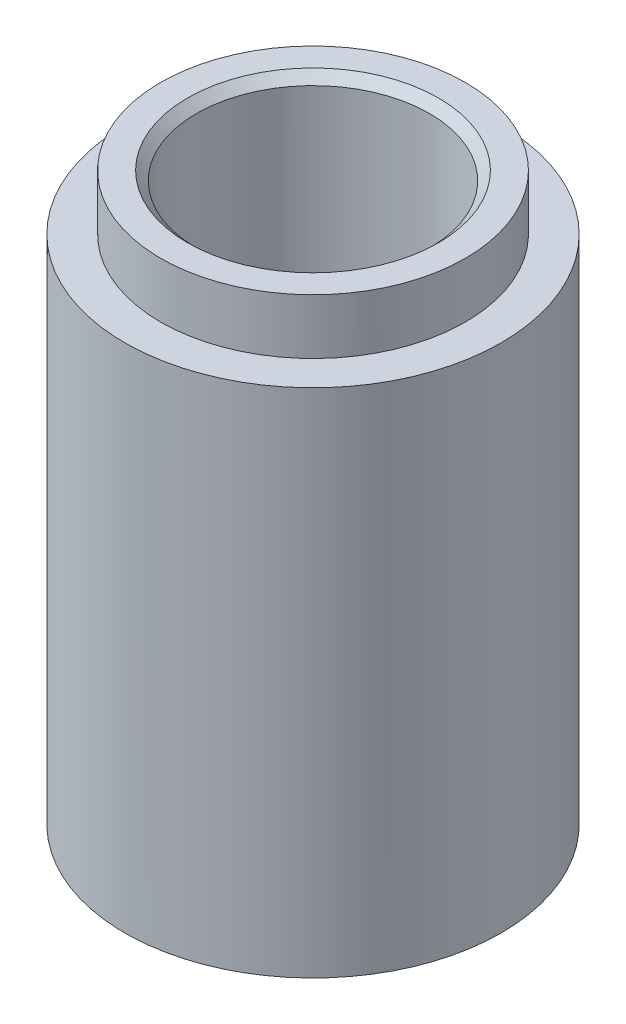
ISO-10303-21;
HEADER;
FILE_DESCRIPTION(('STEP AP214'),'2;1');
FILE_NAME('part.step','',(''),(''),'','','');
FILE_SCHEMA(('AUTOMOTIVE_DESIGN { 1 0 10303 214 1 1 1 1 }'));
ENDSEC;
DATA;
#1=APPLICATION_CONTEXT('core data for automotive mechanical design processes');
#2=APPLICATION_PROTOCOL_DEFINITION('international standard','automotive_design',2000,#1);
#3=PRODUCT_CONTEXT('',#1,'mechanical');
#4=PRODUCT('Part','Part','',(#3));
#5=PRODUCT_RELATED_PRODUCT_CATEGORY('part','',(#4));
#6=PRODUCT_DEFINITION_FORMATION('','',#4);
#7=PRODUCT_DEFINITION_CONTEXT('part definition',#1,'design');
#8=PRODUCT_DEFINITION('design','',#6,#7);
#9=PRODUCT_DEFINITION_SHAPE('','',#8);
#10=(LENGTH_UNIT() NAMED_UNIT(*) SI_UNIT(.MILLI.,.METRE.));
#11=(NAMED_UNIT(*) PLANE_ANGLE_UNIT() SI_UNIT($,.RADIAN.));
#12=(NAMED_UNIT(*) SI_UNIT($,.STERADIAN.) SOLID_ANGLE_UNIT());
#13=UNCERTAINTY_MEASURE_WITH_UNIT(LENGTH_MEASURE(1.E-05),#10,'distance_accuracy_value','');
#14=(GEOMETRIC_REPRESENTATION_CONTEXT(3) GLOBAL_UNCERTAINTY_ASSIGNED_CONTEXT((#13)) GLOBAL_UNIT_ASSIGNED_CONTEXT((#10,
#11,#12)) REPRESENTATION_CONTEXT('',''));
#15=CARTESIAN_POINT('',(0.,0.,0.));
#16=DIRECTION('',(0.,0.,1.));
#17=DIRECTION('',(1.,0.,0.));
#18=AXIS2_PLACEMENT_3D('',#15,#16,#17);
#19=CARTESIAN_POINT('',(81.28,-119.247044001362,0.));
#20=DIRECTION('',(0.,-1.,0.));
#21=DIRECTION('',(0.,0.,-1.));
#22=AXIS2_PLACEMENT_3D('',#19,#20,#21);
#23=CYLINDRICAL_SURFACE('',#22,41.275);
#24=CARTESIAN_POINT('',(81.28,-122.422044001362,0.));
#25=DIRECTION('',(0.,-1.,0.));
#26=DIRECTION('',(0.,0.,-1.));
#27=AXIS2_PLACEMENT_3D('',#24,#25,#26);
#28=CIRCLE('',#27,41.275);
#29=CARTESIAN_POINT('',(81.28,-122.422044001362,-41.275));
#30=VERTEX_POINT('',#29);
#31=EDGE_CURVE('E11',#30,#30,#28,.F.);
#32=ORIENTED_EDGE('',*,*,#31,.T.);
#33=EDGE_LOOP('',(#32));
#34=FACE_BOUND('',#33,.T.);
#35=CARTESIAN_POINT('',(81.28,-319.895132004085,0.));
#36=DIRECTION('',(0.,-1.,0.));
#37=DIRECTION('',(1.,0.,0.));
#38=AXIS2_PLACEMENT_3D('',#35,#36,#37);
#39=CIRCLE('',#38,41.275);
#40=CARTESIAN_POINT('',(122.555,-319.895132004085,0.));
#41=VERTEX_POINT('',#40);
#42=EDGE_CURVE('E264',#41,#41,#39,.T.);
#43=ORIENTED_EDGE('',*,*,#42,.T.);
#44=EDGE_LOOP('',(#43));
#45=FACE_BOUND('',#44,.T.);
#46=ADVANCED_FACE('F16',(#34,#45),#23,.F.);
#47=CARTESIAN_POINT('',(81.28,-119.247044001362,0.));
#48=DIRECTION('',(0.,-1.,0.));
#49=DIRECTION('',(0.,0.,-1.));
#50=AXIS2_PLACEMENT_3D('',#47,#48,#49);
#51=CYLINDRICAL_SURFACE('',#50,53.975);
#52=CARTESIAN_POINT('',(81.28,-119.247044001362,0.));
#53=DIRECTION('',(0.,-1.,0.));
#54=DIRECTION('',(1.,0.,0.));
#55=AXIS2_PLACEMENT_3D('',#52,#53,#54);
#56=CIRCLE('',#55,53.975);
#57=CARTESIAN_POINT('',(135.255,-119.247044001362,0.));
#58=VERTEX_POINT('',#57);
#59=EDGE_CURVE('E268',#58,#58,#56,.T.);
#60=ORIENTED_EDGE('',*,*,#59,.T.);
#61=EDGE_LOOP('',(#60));
#62=FACE_BOUND('',#61,.T.);
#63=CARTESIAN_POINT('',(81.28,-138.805044001362,0.));
#64=DIRECTION('',(0.,-1.,0.));
#65=DIRECTION('',(0.,0.,-1.));
#66=AXIS2_PLACEMENT_3D('',#63,#64,#65);
#67=CIRCLE('',#66,53.975);
#68=CARTESIAN_POINT('',(81.28,-138.805044001362,-53.975));
#69=VERTEX_POINT('',#68);
#70=EDGE_CURVE('E267',#69,#69,#67,.T.);
#71=ORIENTED_EDGE('',*,*,#70,.F.);
#72=EDGE_LOOP('',(#71));
#73=FACE_BOUND('',#72,.T.);
#74=ADVANCED_FACE('F83',(#62,#73),#51,.T.);
#75=CARTESIAN_POINT('',(81.28,-119.247044001362,0.));
#76=DIRECTION('',(0.,-1.,0.));
#77=DIRECTION('',(0.,0.,-1.));
#78=AXIS2_PLACEMENT_3D('',#75,#76,#77);
#79=PLANE('',#78);
#80=CARTESIAN_POINT('',(81.28,-119.247044001362,0.));
#81=DIRECTION('',(0.,-1.,0.));
#82=DIRECTION('',(0.,0.,-1.));
#83=AXIS2_PLACEMENT_3D('',#80,#81,#82);
#84=CIRCLE('',#83,44.45);
#85=CARTESIAN_POINT('',(81.28,-119.247044001362,-44.45));
#86=VERTEX_POINT('',#85);
#87=EDGE_CURVE('E25',#86,#86,#84,.T.);
#88=ORIENTED_EDGE('',*,*,#87,.T.);
#89=EDGE_LOOP('',(#88));
#90=FACE_BOUND('',#89,.T.);
#91=ORIENTED_EDGE('',*,*,#59,.F.);
#92=EDGE_LOOP('',(#91));
#93=FACE_BOUND('',#92,.T.);
#94=ADVANCED_FACE('F89',(#90,#93),#79,.F.);
#95=CARTESIAN_POINT('',(81.28,-319.895132004085,0.));
#96=DIRECTION('',(0.,1.,0.));
#97=DIRECTION('',(0.,0.,1.));
#98=AXIS2_PLACEMENT_3D('',#95,#96,#97);
#99=CYLINDRICAL_SURFACE('',#98,66.675);
#100=CARTESIAN_POINT('',(81.28,-319.895132004085,0.));
#101=DIRECTION('',(0.,-1.,0.));
#102=DIRECTION('',(1.,0.,0.));
#103=AXIS2_PLACEMENT_3D('',#100,#101,#102);
#104=CIRCLE('',#103,66.675);
#105=CARTESIAN_POINT('',(147.955,-319.895132004085,0.));
#106=VERTEX_POINT('',#105);
#107=EDGE_CURVE('E261',#106,#106,#104,.T.);
#108=ORIENTED_EDGE('',*,*,#107,.F.);
#109=EDGE_LOOP('',(#108));
#110=FACE_BOUND('',#109,.T.);
#111=CARTESIAN_POINT('',(81.28,-138.805044001362,0.));
#112=DIRECTION('',(0.,-1.,0.));
#113=DIRECTION('',(0.,0.,-1.));
#114=AXIS2_PLACEMENT_3D('',#111,#112,#113);
#115=CIRCLE('',#114,66.675);
#116=CARTESIAN_POINT('',(81.28,-138.805044001362,-66.675));
#117=VERTEX_POINT('',#116);
#118=EDGE_CURVE('E20',#117,#117,#115,.T.);
#119=ORIENTED_EDGE('',*,*,#118,.T.);
#120=EDGE_LOOP('',(#119));
#121=FACE_BOUND('',#120,.T.);
#122=ADVANCED_FACE('F95',(#110,#121),#99,.T.);
#123=CARTESIAN_POINT('',(81.28,-319.895132004085,0.));
#124=DIRECTION('',(0.,-1.,0.));
#125=DIRECTION('',(0.,0.,-1.));
#126=AXIS2_PLACEMENT_3D('',#123,#124,#125);
#127=PLANE('',#126);
#128=CARTESIAN_POINT('',(51.1175,-319.895132004085,52.2429824832962));
#129=DIRECTION('',(0.,1.,0.));
#130=DIRECTION('',(-0.5,0.,0.866025403784438));
#131=AXIS2_PLACEMENT_3D('',#128,#129,#130);
#132=CIRCLE('',#131,3.175);
#133=CARTESIAN_POINT('',(49.53,-319.895132004085,54.9926131403118));
#134=VERTEX_POINT('',#133);
#135=EDGE_CURVE('E202',#134,#134,#132,.T.);
#136=ORIENTED_EDGE('',*,*,#135,.T.);
#137=EDGE_LOOP('',(#136));
#138=FACE_BOUND('',#137,.T.);
#139=CARTESIAN_POINT('',(29.0370175167037,-319.895132004085,30.1625));
#140=DIRECTION('',(0.,1.,0.));
#141=DIRECTION('',(-0.866025403784439,0.,0.5));
#142=AXIS2_PLACEMENT_3D('',#139,#140,#141);
#143=CIRCLE('',#142,3.175);
#144=CARTESIAN_POINT('',(26.2873868596881,-319.895132004085,31.75));
#145=VERTEX_POINT('',#144);
#146=EDGE_CURVE('E193',#145,#145,#143,.T.);
#147=ORIENTED_EDGE('',*,*,#146,.T.);
#148=EDGE_LOOP('',(#147));
#149=FACE_BOUND('',#148,.T.);
#150=CARTESIAN_POINT('',(20.955,-319.895132004085,0.));
#151=DIRECTION('',(0.,1.,0.));
#152=DIRECTION('',(-1.,0.,0.));
#153=AXIS2_PLACEMENT_3D('',#150,#151,#152);
#154=CIRCLE('',#153,3.175);
#155=CARTESIAN_POINT('',(17.78,-319.895132004085,0.));
#156=VERTEX_POINT('',#155);
#157=EDGE_CURVE('E192',#156,#156,#154,.T.);
#158=ORIENTED_EDGE('',*,*,#157,.T.);
#159=EDGE_LOOP('',(#158));
#160=FACE_BOUND('',#159,.T.);
#161=CARTESIAN_POINT('',(29.0370175167038,-319.895132004085,-30.1625));
#162=DIRECTION('',(0.,1.,0.));
#163=DIRECTION('',(-0.866025403784438,0.,-0.5));
#164=AXIS2_PLACEMENT_3D('',#161,#162,#163);
#165=CIRCLE('',#164,3.175);
#166=CARTESIAN_POINT('',(26.2873868596882,-319.895132004085,-31.75));
#167=VERTEX_POINT('',#166);
#168=EDGE_CURVE('E206',#167,#167,#165,.T.);
#169=ORIENTED_EDGE('',*,*,#168,.T.);
#170=EDGE_LOOP('',(#169));
#171=FACE_BOUND('',#170,.T.);
#172=CARTESIAN_POINT('',(51.1175,-319.895132004085,-52.2429824832962));
#173=DIRECTION('',(0.,1.,0.));
#174=DIRECTION('',(-0.5,0.,-0.866025403784439));
#175=AXIS2_PLACEMENT_3D('',#172,#173,#174);
#176=CIRCLE('',#175,3.175);
#177=CARTESIAN_POINT('',(49.53,-319.895132004085,-54.9926131403118));
#178=VERTEX_POINT('',#177);
#179=EDGE_CURVE('E211',#178,#178,#176,.T.);
#180=ORIENTED_EDGE('',*,*,#179,.T.);
#181=EDGE_LOOP('',(#180));
#182=FACE_BOUND('',#181,.T.);
#183=CARTESIAN_POINT('',(81.28,-319.895132004085,-60.325));
#184=DIRECTION('',(0.,1.,0.));
#185=DIRECTION('',(0.,0.,-1.));
#186=AXIS2_PLACEMENT_3D('',#183,#184,#185);
#187=CIRCLE('',#186,3.175);
#188=CARTESIAN_POINT('',(81.28,-319.895132004085,-63.5));
#189=VERTEX_POINT('',#188);
#190=EDGE_CURVE('E217',#189,#189,#187,.T.);
#191=ORIENTED_EDGE('',*,*,#190,.T.);
#192=EDGE_LOOP('',(#191));
#193=FACE_BOUND('',#192,.T.);
#194=CARTESIAN_POINT('',(111.4425,-319.895132004085,-52.2429824832962));
#195=DIRECTION('',(0.,1.,0.));
#196=DIRECTION('',(0.5,0.,-0.866025403784439));
#197=AXIS2_PLACEMENT_3D('',#194,#195,#196);
#198=CIRCLE('',#197,3.175);
#199=CARTESIAN_POINT('',(113.03,-319.895132004085,-54.9926131403118));
#200=VERTEX_POINT('',#199);
#201=EDGE_CURVE('E223',#200,#200,#198,.T.);
#202=ORIENTED_EDGE('',*,*,#201,.T.);
#203=EDGE_LOOP('',(#202));
#204=FACE_BOUND('',#203,.T.);
#205=CARTESIAN_POINT('',(133.522982483296,-319.895132004085,-30.1625));
#206=DIRECTION('',(0.,1.,0.));
#207=DIRECTION('',(0.866025403784439,0.,-0.5));
#208=AXIS2_PLACEMENT_3D('',#205,#206,#207);
#209=CIRCLE('',#208,3.175);
#210=CARTESIAN_POINT('',(136.272613140312,-319.895132004085,-31.75));
#211=VERTEX_POINT('',#210);
#212=EDGE_CURVE('E229',#211,#211,#209,.T.);
#213=ORIENTED_EDGE('',*,*,#212,.T.);
#214=EDGE_LOOP('',(#213));
#215=FACE_BOUND('',#214,.T.);
#216=CARTESIAN_POINT('',(141.605,-319.895132004085,0.));
#217=DIRECTION('',(0.,1.,0.));
#218=DIRECTION('',(1.,0.,0.));
#219=AXIS2_PLACEMENT_3D('',#216,#217,#218);
#220=CIRCLE('',#219,3.175);
#221=CARTESIAN_POINT('',(144.78,-319.895132004085,0.));
#222=VERTEX_POINT('',#221);
#223=EDGE_CURVE('E235',#222,#222,#220,.T.);
#224=ORIENTED_EDGE('',*,*,#223,.T.);
#225=EDGE_LOOP('',(#224));
#226=FACE_BOUND('',#225,.T.);
#227=CARTESIAN_POINT('',(133.522982483296,-319.895132004085,30.1625));
#228=DIRECTION('',(0.,1.,0.));
#229=DIRECTION('',(0.866025403784439,0.,0.5));
#230=AXIS2_PLACEMENT_3D('',#227,#228,#229);
#231=CIRCLE('',#230,3.175);
#232=CARTESIAN_POINT('',(136.272613140312,-319.895132004085,31.75));
#233=VERTEX_POINT('',#232);
#234=EDGE_CURVE('E241',#233,#233,#231,.T.);
#235=ORIENTED_EDGE('',*,*,#234,.T.);
#236=EDGE_LOOP('',(#235));
#237=FACE_BOUND('',#236,.T.);
#238=CARTESIAN_POINT('',(111.4425,-319.895132004085,52.2429824832963));
#239=DIRECTION('',(0.,1.,0.));
#240=DIRECTION('',(0.5,0.,0.866025403784439));
#241=AXIS2_PLACEMENT_3D('',#238,#239,#240);
#242=CIRCLE('',#241,3.175);
#243=CARTESIAN_POINT('',(113.03,-319.895132004085,54.9926131403119));
#244=VERTEX_POINT('',#243);
#245=EDGE_CURVE('E247',#244,#244,#242,.T.);
#246=ORIENTED_EDGE('',*,*,#245,.T.);
#247=EDGE_LOOP('',(#246));
#248=FACE_BOUND('',#247,.T.);
#249=CARTESIAN_POINT('',(81.28,-319.895132004085,60.325));
#250=DIRECTION('',(0.,1.,0.));
#251=DIRECTION('',(0.,0.,1.));
#252=AXIS2_PLACEMENT_3D('',#249,#250,#251);
#253=CIRCLE('',#252,3.175);
#254=CARTESIAN_POINT('',(81.28,-319.895132004085,63.5));
#255=VERTEX_POINT('',#254);
#256=EDGE_CURVE('E253',#255,#255,#253,.T.);
#257=ORIENTED_EDGE('',*,*,#256,.T.);
#258=EDGE_LOOP('',(#257));
#259=FACE_BOUND('',#258,.T.);
#260=ORIENTED_EDGE('',*,*,#42,.F.);
#261=EDGE_LOOP('',(#260));
#262=FACE_BOUND('',#261,.T.);
#263=ORIENTED_EDGE('',*,*,#107,.T.);
#264=EDGE_LOOP('',(#263));
#265=FACE_BOUND('',#264,.T.);
#266=ADVANCED_FACE('F99',(#138,#149,#160,#171,#182,#193,#204,#215,#226,#237,#248,#259,#262,
#265),#127,.T.);
#267=CARTESIAN_POINT('',(81.28,-138.805044001362,0.));
#268=DIRECTION('',(0.,-1.,0.));
#269=DIRECTION('',(0.,0.,-1.));
#270=AXIS2_PLACEMENT_3D('',#267,#268,#269);
#271=PLANE('',#270);
#272=ORIENTED_EDGE('',*,*,#70,.T.);
#273=EDGE_LOOP('',(#272));
#274=FACE_BOUND('',#273,.T.);
#275=ORIENTED_EDGE('',*,*,#118,.F.);
#276=EDGE_LOOP('',(#275));
#277=FACE_BOUND('',#276,.T.);
#278=ADVANCED_FACE('F18',(#274,#277),#271,.F.);
#279=CARTESIAN_POINT('',(81.28,-294.495132004085,60.325));
#280=DIRECTION('',(0.,-1.,0.));
#281=DIRECTION('',(0.,0.,-1.));
#282=AXIS2_PLACEMENT_3D('',#279,#280,#281);
#283=CONICAL_SURFACE('',#282,3.175,1.02974425867665);
#284=CARTESIAN_POINT('',(81.28,-294.495132004085,60.325));
#285=DIRECTION('',(0.,1.,0.));
#286=DIRECTION('',(0.,0.,1.));
#287=AXIS2_PLACEMENT_3D('',#284,#285,#286);
#288=CIRCLE('',#287,3.175);
#289=CARTESIAN_POINT('',(81.28,-294.495132004085,63.5));
#290=VERTEX_POINT('',#289);
#291=EDGE_CURVE('E256',#290,#290,#288,.T.);
#292=ORIENTED_EDGE('',*,*,#291,.F.);
#293=EDGE_LOOP('',(#292));
#294=FACE_BOUND('',#293,.T.);
#295=CARTESIAN_POINT('',(81.28,-292.587399538673,60.325));
#296=VERTEX_POINT('',#295);
#297=VERTEX_LOOP('',#296);
#298=FACE_BOUND('',#297,.T.);
#299=ADVANCED_FACE('F108',(#294,#298),#283,.F.);
#300=CARTESIAN_POINT('',(81.28,-319.895132004085,60.325));
#301=DIRECTION('',(0.,1.,0.));
#302=DIRECTION('',(0.,0.,1.));
#303=AXIS2_PLACEMENT_3D('',#300,#301,#302);
#304=CYLINDRICAL_SURFACE('',#303,3.175);
#305=ORIENTED_EDGE('',*,*,#291,.T.);
#306=EDGE_LOOP('',(#305));
#307=FACE_BOUND('',#306,.T.);
#308=ORIENTED_EDGE('',*,*,#256,.F.);
#309=EDGE_LOOP('',(#308));
#310=FACE_BOUND('',#309,.T.);
#311=ADVANCED_FACE('F104',(#307,#310),#304,.F.);
#312=CARTESIAN_POINT('',(111.4425,-294.495132004085,52.2429824832963));
#313=DIRECTION('',(0.,-1.,0.));
#314=DIRECTION('',(-0.5,0.,-0.866025403784439));
#315=AXIS2_PLACEMENT_3D('',#312,#313,#314);
#316=CONICAL_SURFACE('',#315,3.175,1.02974425867665);
#317=CARTESIAN_POINT('',(111.4425,-294.495132004085,52.2429824832963));
#318=DIRECTION('',(0.,1.,0.));
#319=DIRECTION('',(0.5,0.,0.866025403784439));
#320=AXIS2_PLACEMENT_3D('',#317,#318,#319);
#321=CIRCLE('',#320,3.175);
#322=CARTESIAN_POINT('',(113.03,-294.495132004085,54.9926131403119));
#323=VERTEX_POINT('',#322);
#324=EDGE_CURVE('E250',#323,#323,#321,.T.);
#325=ORIENTED_EDGE('',*,*,#324,.F.);
#326=EDGE_LOOP('',(#325));
#327=FACE_BOUND('',#326,.T.);
#328=CARTESIAN_POINT('',(111.4425,-292.587399538673,52.2429824832963));
#329=VERTEX_POINT('',#328);
#330=VERTEX_LOOP('',#329);
#331=FACE_BOUND('',#330,.T.);
#332=ADVANCED_FACE('F107',(#327,#331),#316,.F.);
#333=CARTESIAN_POINT('',(111.4425,-319.895132004085,52.2429824832963));
#334=DIRECTION('',(0.,1.,0.));
#335=DIRECTION('',(0.5,0.,0.866025403784439));
#336=AXIS2_PLACEMENT_3D('',#333,#334,#335);
#337=CYLINDRICAL_SURFACE('',#336,3.175);
#338=ORIENTED_EDGE('',*,*,#324,.T.);
#339=EDGE_LOOP('',(#338));
#340=FACE_BOUND('',#339,.T.);
#341=ORIENTED_EDGE('',*,*,#245,.F.);
#342=EDGE_LOOP('',(#341));
#343=FACE_BOUND('',#342,.T.);
#344=ADVANCED_FACE('F113',(#340,#343),#337,.F.);
#345=CARTESIAN_POINT('',(133.522982483296,-294.495132004085,30.1625));
#346=DIRECTION('',(0.,-1.,0.));
#347=DIRECTION('',(-0.866025403784439,0.,-0.5));
#348=AXIS2_PLACEMENT_3D('',#345,#346,#347);
#349=CONICAL_SURFACE('',#348,3.175,1.02974425867665);
#350=CARTESIAN_POINT('',(133.522982483296,-294.495132004085,30.1625));
#351=DIRECTION('',(0.,1.,0.));
#352=DIRECTION('',(0.866025403784439,0.,0.5));
#353=AXIS2_PLACEMENT_3D('',#350,#351,#352);
#354=CIRCLE('',#353,3.175);
#355=CARTESIAN_POINT('',(136.272613140312,-294.495132004085,31.75));
#356=VERTEX_POINT('',#355);
#357=EDGE_CURVE('E244',#356,#356,#354,.T.);
#358=ORIENTED_EDGE('',*,*,#357,.F.);
#359=EDGE_LOOP('',(#358));
#360=FACE_BOUND('',#359,.T.);
#361=CARTESIAN_POINT('',(133.522982483296,-292.587399538673,30.1625));
#362=VERTEX_POINT('',#361);
#363=VERTEX_LOOP('',#362);
#364=FACE_BOUND('',#363,.T.);
#365=ADVANCED_FACE('F116',(#360,#364),#349,.F.);
#366=CARTESIAN_POINT('',(133.522982483296,-319.895132004085,30.1625));
#367=DIRECTION('',(0.,1.,0.));
#368=DIRECTION('',(0.866025403784439,0.,0.5));
#369=AXIS2_PLACEMENT_3D('',#366,#367,#368);
#370=CYLINDRICAL_SURFACE('',#369,3.175);
#371=ORIENTED_EDGE('',*,*,#357,.T.);
#372=EDGE_LOOP('',(#371));
#373=FACE_BOUND('',#372,.T.);
#374=ORIENTED_EDGE('',*,*,#234,.F.);
#375=EDGE_LOOP('',(#374));
#376=FACE_BOUND('',#375,.T.);
#377=ADVANCED_FACE('F121',(#373,#376),#370,.F.);
#378=CARTESIAN_POINT('',(141.605,-294.495132004085,0.));
#379=DIRECTION('',(0.,-1.,0.));
#380=DIRECTION('',(-1.,0.,0.));
#381=AXIS2_PLACEMENT_3D('',#378,#379,#380);
#382=CONICAL_SURFACE('',#381,3.175,1.02974425867665);
#383=CARTESIAN_POINT('',(141.605,-294.495132004085,0.));
#384=DIRECTION('',(0.,1.,0.));
#385=DIRECTION('',(1.,0.,0.));
#386=AXIS2_PLACEMENT_3D('',#383,#384,#385);
#387=CIRCLE('',#386,3.175);
#388=CARTESIAN_POINT('',(144.78,-294.495132004085,0.));
#389=VERTEX_POINT('',#388);
#390=EDGE_CURVE('E238',#389,#389,#387,.T.);
#391=ORIENTED_EDGE('',*,*,#390,.F.);
#392=EDGE_LOOP('',(#391));
#393=FACE_BOUND('',#392,.T.);
#394=CARTESIAN_POINT('',(141.605,-292.587399538673,0.));
#395=VERTEX_POINT('',#394);
#396=VERTEX_LOOP('',#395);
#397=FACE_BOUND('',#396,.T.);
#398=ADVANCED_FACE('F124',(#393,#397),#382,.F.);
#399=CARTESIAN_POINT('',(141.605,-319.895132004085,0.));
#400=DIRECTION('',(0.,1.,0.));
#401=DIRECTION('',(1.,0.,0.));
#402=AXIS2_PLACEMENT_3D('',#399,#400,#401);
#403=CYLINDRICAL_SURFACE('',#402,3.175);
#404=ORIENTED_EDGE('',*,*,#390,.T.);
#405=EDGE_LOOP('',(#404));
#406=FACE_BOUND('',#405,.T.);
#407=ORIENTED_EDGE('',*,*,#223,.F.);
#408=EDGE_LOOP('',(#407));
#409=FACE_BOUND('',#408,.T.);
#410=ADVANCED_FACE('F129',(#406,#409),#403,.F.);
#411=CARTESIAN_POINT('',(133.522982483296,-294.495132004085,-30.1625));
#412=DIRECTION('',(0.,-1.,0.));
#413=DIRECTION('',(-0.866025403784439,0.,0.5));
#414=AXIS2_PLACEMENT_3D('',#411,#412,#413);
#415=CONICAL_SURFACE('',#414,3.175,1.02974425867665);
#416=CARTESIAN_POINT('',(133.522982483296,-294.495132004085,-30.1625));
#417=DIRECTION('',(0.,1.,0.));
#418=DIRECTION('',(0.866025403784439,0.,-0.5));
#419=AXIS2_PLACEMENT_3D('',#416,#417,#418);
#420=CIRCLE('',#419,3.175);
#421=CARTESIAN_POINT('',(136.272613140312,-294.495132004085,-31.75));
#422=VERTEX_POINT('',#421);
#423=EDGE_CURVE('E232',#422,#422,#420,.T.);
#424=ORIENTED_EDGE('',*,*,#423,.F.);
#425=EDGE_LOOP('',(#424));
#426=FACE_BOUND('',#425,.T.);
#427=CARTESIAN_POINT('',(133.522982483296,-292.587399538673,-30.1625));
#428=VERTEX_POINT('',#427);
#429=VERTEX_LOOP('',#428);
#430=FACE_BOUND('',#429,.T.);
#431=ADVANCED_FACE('F132',(#426,#430),#415,.F.);
#432=CARTESIAN_POINT('',(133.522982483296,-319.895132004085,-30.1625));
#433=DIRECTION('',(0.,1.,0.));
#434=DIRECTION('',(0.866025403784439,0.,-0.5));
#435=AXIS2_PLACEMENT_3D('',#432,#433,#434);
#436=CYLINDRICAL_SURFACE('',#435,3.175);
#437=ORIENTED_EDGE('',*,*,#423,.T.);
#438=EDGE_LOOP('',(#437));
#439=FACE_BOUND('',#438,.T.);
#440=ORIENTED_EDGE('',*,*,#212,.F.);
#441=EDGE_LOOP('',(#440));
#442=FACE_BOUND('',#441,.T.);
#443=ADVANCED_FACE('F137',(#439,#442),#436,.F.);
#444=CARTESIAN_POINT('',(111.4425,-294.495132004085,-52.2429824832962));
#445=DIRECTION('',(0.,-1.,0.));
#446=DIRECTION('',(-0.5,0.,0.866025403784439));
#447=AXIS2_PLACEMENT_3D('',#444,#445,#446);
#448=CONICAL_SURFACE('',#447,3.175,1.02974425867665);
#449=CARTESIAN_POINT('',(111.4425,-294.495132004085,-52.2429824832962));
#450=DIRECTION('',(0.,1.,0.));
#451=DIRECTION('',(0.5,0.,-0.866025403784439));
#452=AXIS2_PLACEMENT_3D('',#449,#450,#451);
#453=CIRCLE('',#452,3.175);
#454=CARTESIAN_POINT('',(113.03,-294.495132004085,-54.9926131403118));
#455=VERTEX_POINT('',#454);
#456=EDGE_CURVE('E226',#455,#455,#453,.T.);
#457=ORIENTED_EDGE('',*,*,#456,.F.);
#458=EDGE_LOOP('',(#457));
#459=FACE_BOUND('',#458,.T.);
#460=CARTESIAN_POINT('',(111.4425,-292.587399538673,-52.2429824832962));
#461=VERTEX_POINT('',#460);
#462=VERTEX_LOOP('',#461);
#463=FACE_BOUND('',#462,.T.);
#464=ADVANCED_FACE('F140',(#459,#463),#448,.F.);
#465=CARTESIAN_POINT('',(111.4425,-319.895132004085,-52.2429824832962));
#466=DIRECTION('',(0.,1.,0.));
#467=DIRECTION('',(0.5,0.,-0.866025403784439));
#468=AXIS2_PLACEMENT_3D('',#465,#466,#467);
#469=CYLINDRICAL_SURFACE('',#468,3.175);
#470=ORIENTED_EDGE('',*,*,#456,.T.);
#471=EDGE_LOOP('',(#470));
#472=FACE_BOUND('',#471,.T.);
#473=ORIENTED_EDGE('',*,*,#201,.F.);
#474=EDGE_LOOP('',(#473));
#475=FACE_BOUND('',#474,.T.);
#476=ADVANCED_FACE('F145',(#472,#475),#469,.F.);
#477=CARTESIAN_POINT('',(81.28,-294.495132004085,-60.325));
#478=DIRECTION('',(0.,-1.,0.));
#479=DIRECTION('',(0.,0.,1.));
#480=AXIS2_PLACEMENT_3D('',#477,#478,#479);
#481=CONICAL_SURFACE('',#480,3.175,1.02974425867665);
#482=CARTESIAN_POINT('',(81.28,-294.495132004085,-60.325));
#483=DIRECTION('',(0.,1.,0.));
#484=DIRECTION('',(0.,0.,-1.));
#485=AXIS2_PLACEMENT_3D('',#482,#483,#484);
#486=CIRCLE('',#485,3.175);
#487=CARTESIAN_POINT('',(81.28,-294.495132004085,-63.5));
#488=VERTEX_POINT('',#487);
#489=EDGE_CURVE('E220',#488,#488,#486,.T.);
#490=ORIENTED_EDGE('',*,*,#489,.F.);
#491=EDGE_LOOP('',(#490));
#492=FACE_BOUND('',#491,.T.);
#493=CARTESIAN_POINT('',(81.28,-292.587399538673,-60.325));
#494=VERTEX_POINT('',#493);
#495=VERTEX_LOOP('',#494);
#496=FACE_BOUND('',#495,.T.);
#497=ADVANCED_FACE('F148',(#492,#496),#481,.F.);
#498=CARTESIAN_POINT('',(81.28,-319.895132004085,-60.325));
#499=DIRECTION('',(0.,1.,0.));
#500=DIRECTION('',(0.,0.,-1.));
#501=AXIS2_PLACEMENT_3D('',#498,#499,#500);
#502=CYLINDRICAL_SURFACE('',#501,3.175);
#503=ORIENTED_EDGE('',*,*,#489,.T.);
#504=EDGE_LOOP('',(#503));
#505=FACE_BOUND('',#504,.T.);
#506=ORIENTED_EDGE('',*,*,#190,.F.);
#507=EDGE_LOOP('',(#506));
#508=FACE_BOUND('',#507,.T.);
#509=ADVANCED_FACE('F153',(#505,#508),#502,.F.);
#510=CARTESIAN_POINT('',(51.1175,-294.495132004085,-52.2429824832962));
#511=DIRECTION('',(0.,-1.,0.));
#512=DIRECTION('',(0.5,0.,0.866025403784439));
#513=AXIS2_PLACEMENT_3D('',#510,#511,#512);
#514=CONICAL_SURFACE('',#513,3.175,1.02974425867665);
#515=CARTESIAN_POINT('',(51.1175,-294.495132004085,-52.2429824832962));
#516=DIRECTION('',(0.,1.,0.));
#517=DIRECTION('',(-0.5,0.,-0.866025403784439));
#518=AXIS2_PLACEMENT_3D('',#515,#516,#517);
#519=CIRCLE('',#518,3.175);
#520=CARTESIAN_POINT('',(49.53,-294.495132004085,-54.9926131403118));
#521=VERTEX_POINT('',#520);
#522=EDGE_CURVE('E214',#521,#521,#519,.T.);
#523=ORIENTED_EDGE('',*,*,#522,.F.);
#524=EDGE_LOOP('',(#523));
#525=FACE_BOUND('',#524,.T.);
#526=CARTESIAN_POINT('',(51.1175,-292.587399538673,-52.2429824832962));
#527=VERTEX_POINT('',#526);
#528=VERTEX_LOOP('',#527);
#529=FACE_BOUND('',#528,.T.);
#530=ADVANCED_FACE('F156',(#525,#529),#514,.F.);
#531=CARTESIAN_POINT('',(51.1175,-319.895132004085,-52.2429824832962));
#532=DIRECTION('',(0.,1.,0.));
#533=DIRECTION('',(-0.5,0.,-0.866025403784439));
#534=AXIS2_PLACEMENT_3D('',#531,#532,#533);
#535=CYLINDRICAL_SURFACE('',#534,3.175);
#536=ORIENTED_EDGE('',*,*,#522,.T.);
#537=EDGE_LOOP('',(#536));
#538=FACE_BOUND('',#537,.T.);
#539=ORIENTED_EDGE('',*,*,#179,.F.);
#540=EDGE_LOOP('',(#539));
#541=FACE_BOUND('',#540,.T.);
#542=ADVANCED_FACE('F161',(#538,#541),#535,.F.);
#543=CARTESIAN_POINT('',(29.0370175167038,-294.495132004085,-30.1625));
#544=DIRECTION('',(0.,-1.,0.));
#545=DIRECTION('',(0.866025403784438,0.,0.5));
#546=AXIS2_PLACEMENT_3D('',#543,#544,#545);
#547=CONICAL_SURFACE('',#546,3.175,1.02974425867665);
#548=CARTESIAN_POINT('',(29.0370175167038,-294.495132004085,-30.1625));
#549=DIRECTION('',(0.,1.,0.));
#550=DIRECTION('',(-0.866025403784438,0.,-0.5));
#551=AXIS2_PLACEMENT_3D('',#548,#549,#550);
#552=CIRCLE('',#551,3.175);
#553=CARTESIAN_POINT('',(26.2873868596882,-294.495132004085,-31.75));
#554=VERTEX_POINT('',#553);
#555=EDGE_CURVE('E208',#554,#554,#552,.T.);
#556=ORIENTED_EDGE('',*,*,#555,.F.);
#557=EDGE_LOOP('',(#556));
#558=FACE_BOUND('',#557,.T.);
#559=CARTESIAN_POINT('',(29.0370175167038,-292.587399538673,-30.1625));
#560=VERTEX_POINT('',#559);
#561=VERTEX_LOOP('',#560);
#562=FACE_BOUND('',#561,.T.);
#563=ADVANCED_FACE('F164',(#558,#562),#547,.F.);
#564=CARTESIAN_POINT('',(29.0370175167038,-319.895132004085,-30.1625));
#565=DIRECTION('',(0.,1.,0.));
#566=DIRECTION('',(-0.866025403784438,0.,-0.5));
#567=AXIS2_PLACEMENT_3D('',#564,#565,#566);
#568=CYLINDRICAL_SURFACE('',#567,3.175);
#569=ORIENTED_EDGE('',*,*,#555,.T.);
#570=EDGE_LOOP('',(#569));
#571=FACE_BOUND('',#570,.T.);
#572=ORIENTED_EDGE('',*,*,#168,.F.);
#573=EDGE_LOOP('',(#572));
#574=FACE_BOUND('',#573,.T.);
#575=ADVANCED_FACE('F169',(#571,#574),#568,.F.);
#576=CARTESIAN_POINT('',(20.955,-294.495132004085,0.));
#577=DIRECTION('',(0.,-1.,0.));
#578=DIRECTION('',(1.,0.,0.));
#579=AXIS2_PLACEMENT_3D('',#576,#577,#578);
#580=CONICAL_SURFACE('',#579,3.175,1.02974425867665);
#581=CARTESIAN_POINT('',(20.955,-294.495132004085,0.));
#582=DIRECTION('',(0.,1.,0.));
#583=DIRECTION('',(-1.,0.,0.));
#584=AXIS2_PLACEMENT_3D('',#581,#582,#583);
#585=CIRCLE('',#584,3.175);
#586=CARTESIAN_POINT('',(17.78,-294.495132004085,0.));
#587=VERTEX_POINT('',#586);
#588=EDGE_CURVE('E196',#587,#587,#585,.T.);
#589=ORIENTED_EDGE('',*,*,#588,.F.);
#590=EDGE_LOOP('',(#589));
#591=FACE_BOUND('',#590,.T.);
#592=CARTESIAN_POINT('',(20.955,-292.587399538673,0.));
#593=VERTEX_POINT('',#592);
#594=VERTEX_LOOP('',#593);
#595=FACE_BOUND('',#594,.T.);
#596=ADVANCED_FACE('F172',(#591,#595),#580,.F.);
#597=CARTESIAN_POINT('',(20.955,-319.895132004085,0.));
#598=DIRECTION('',(0.,1.,0.));
#599=DIRECTION('',(-1.,0.,0.));
#600=AXIS2_PLACEMENT_3D('',#597,#598,#599);
#601=CYLINDRICAL_SURFACE('',#600,3.175);
#602=ORIENTED_EDGE('',*,*,#588,.T.);
#603=EDGE_LOOP('',(#602));
#604=FACE_BOUND('',#603,.T.);
#605=ORIENTED_EDGE('',*,*,#157,.F.);
#606=EDGE_LOOP('',(#605));
#607=FACE_BOUND('',#606,.T.);
#608=ADVANCED_FACE('F177',(#604,#607),#601,.F.);
#609=CARTESIAN_POINT('',(29.0370175167037,-294.495132004085,30.1625));
#610=DIRECTION('',(0.,-1.,0.));
#611=DIRECTION('',(0.866025403784439,0.,-0.5));
#612=AXIS2_PLACEMENT_3D('',#609,#610,#611);
#613=CONICAL_SURFACE('',#612,3.175,1.02974425867665);
#614=CARTESIAN_POINT('',(29.0370175167037,-294.495132004085,30.1625));
#615=DIRECTION('',(0.,1.,0.));
#616=DIRECTION('',(-0.866025403784439,0.,0.5));
#617=AXIS2_PLACEMENT_3D('',#614,#615,#616);
#618=CIRCLE('',#617,3.175);
#619=CARTESIAN_POINT('',(26.2873868596881,-294.495132004085,31.75));
#620=VERTEX_POINT('',#619);
#621=EDGE_CURVE('E191',#620,#620,#618,.T.);
#622=ORIENTED_EDGE('',*,*,#621,.F.);
#623=EDGE_LOOP('',(#622));
#624=FACE_BOUND('',#623,.T.);
#625=CARTESIAN_POINT('',(29.0370175167037,-292.587399538673,30.1625));
#626=VERTEX_POINT('',#625);
#627=VERTEX_LOOP('',#626);
#628=FACE_BOUND('',#627,.T.);
#629=ADVANCED_FACE('F77',(#624,#628),#613,.F.);
#630=CARTESIAN_POINT('',(29.0370175167037,-319.895132004085,30.1625));
#631=DIRECTION('',(0.,1.,0.));
#632=DIRECTION('',(-0.866025403784439,0.,0.5));
#633=AXIS2_PLACEMENT_3D('',#630,#631,#632);
#634=CYLINDRICAL_SURFACE('',#633,3.175);
#635=ORIENTED_EDGE('',*,*,#621,.T.);
#636=EDGE_LOOP('',(#635));
#637=FACE_BOUND('',#636,.T.);
#638=ORIENTED_EDGE('',*,*,#146,.F.);
#639=EDGE_LOOP('',(#638));
#640=FACE_BOUND('',#639,.T.);
#641=ADVANCED_FACE('F66',(#637,#640),#634,.F.);
#642=CARTESIAN_POINT('',(51.1175,-294.495132004085,52.2429824832962));
#643=DIRECTION('',(0.,-1.,0.));
#644=DIRECTION('',(0.5,0.,-0.866025403784438));
#645=AXIS2_PLACEMENT_3D('',#642,#643,#644);
#646=CONICAL_SURFACE('',#645,3.175,1.02974425867665);
#647=CARTESIAN_POINT('',(51.1175,-294.495132004085,52.2429824832962));
#648=DIRECTION('',(0.,1.,0.));
#649=DIRECTION('',(-0.5,0.,0.866025403784438));
#650=AXIS2_PLACEMENT_3D('',#647,#648,#649);
#651=CIRCLE('',#650,3.175);
#652=CARTESIAN_POINT('',(49.53,-294.495132004085,54.9926131403118));
#653=VERTEX_POINT('',#652);
#654=EDGE_CURVE('E199',#653,#653,#651,.T.);
#655=ORIENTED_EDGE('',*,*,#654,.F.);
#656=EDGE_LOOP('',(#655));
#657=FACE_BOUND('',#656,.T.);
#658=CARTESIAN_POINT('',(51.1175,-292.587399538673,52.2429824832962));
#659=VERTEX_POINT('',#658);
#660=VERTEX_LOOP('',#659);
#661=FACE_BOUND('',#660,.T.);
#662=ADVANCED_FACE('F63',(#657,#661),#646,.F.);
#663=CARTESIAN_POINT('',(51.1175,-319.895132004085,52.2429824832962));
#664=DIRECTION('',(0.,1.,0.));
#665=DIRECTION('',(-0.5,0.,0.866025403784438));
#666=AXIS2_PLACEMENT_3D('',#663,#664,#665);
#667=CYLINDRICAL_SURFACE('',#666,3.175);
#668=ORIENTED_EDGE('',*,*,#654,.T.);
#669=EDGE_LOOP('',(#668));
#670=FACE_BOUND('',#669,.T.);
#671=ORIENTED_EDGE('',*,*,#135,.F.);
#672=EDGE_LOOP('',(#671));
#673=FACE_BOUND('',#672,.T.);
#674=ADVANCED_FACE('F65',(#670,#673),#667,.F.);
#675=CARTESIAN_POINT('',(81.28,-119.247044001362,0.));
#676=DIRECTION('',(0.,1.,0.));
#677=DIRECTION('',(0.,0.,1.));
#678=AXIS2_PLACEMENT_3D('',#675,#676,#677);
#679=CONICAL_SURFACE('',#678,44.45,0.785398163397448);
#680=ORIENTED_EDGE('',*,*,#31,.F.);
#681=EDGE_LOOP('',(#680));
#682=FACE_BOUND('',#681,.T.);
#683=ORIENTED_EDGE('',*,*,#87,.F.);
#684=EDGE_LOOP('',(#683));
#685=FACE_BOUND('',#684,.T.);
#686=ADVANCED_FACE('F74',(#682,#685),#679,.F.);
#687=CLOSED_SHELL('',(#46,#74,#94,#122,#266,#278,#299,#311,#332,#344,#365,#377,#398,#410,#431,
#443,#464,#476,#497,#509,#530,#542,#563,#575,#596,#608,#629,#641,#662,#674,#686));
#688=MANIFOLD_SOLID_BREP('B1',#687);
#689=ADVANCED_BREP_SHAPE_REPRESENTATION('',(#18,#688),#14);
#690=SHAPE_DEFINITION_REPRESENTATION(#9,#689);
ENDSEC;
END-ISO-10303-21;
